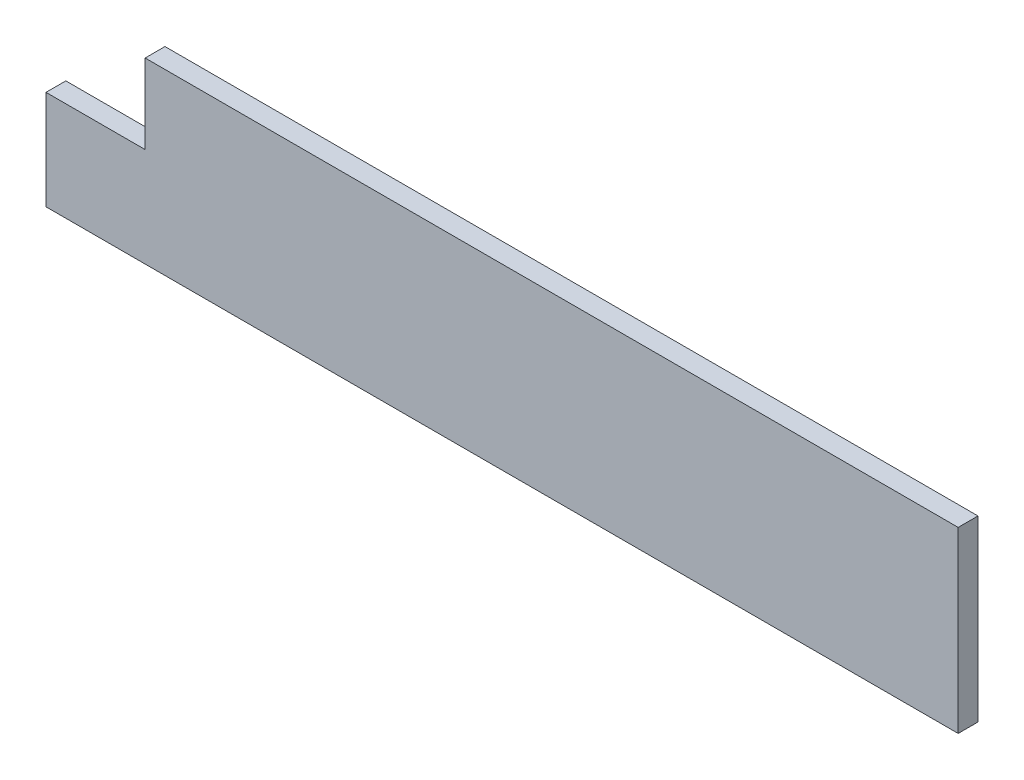
ISO-10303-21;
HEADER;
FILE_DESCRIPTION(('STEP AP214'),'2;1');
FILE_NAME('part.step','',(''),(''),'','','');
FILE_SCHEMA(('AUTOMOTIVE_DESIGN { 1 0 10303 214 1 1 1 1 }'));
ENDSEC;
DATA;
#1=APPLICATION_CONTEXT('core data for automotive mechanical design processes');
#2=APPLICATION_PROTOCOL_DEFINITION('international standard','automotive_design',2000,#1);
#3=PRODUCT_CONTEXT('',#1,'mechanical');
#4=PRODUCT('Part','Part','',(#3));
#5=PRODUCT_RELATED_PRODUCT_CATEGORY('part','',(#4));
#6=PRODUCT_DEFINITION_FORMATION('','',#4);
#7=PRODUCT_DEFINITION_CONTEXT('part definition',#1,'design');
#8=PRODUCT_DEFINITION('design','',#6,#7);
#9=PRODUCT_DEFINITION_SHAPE('','',#8);
#10=(LENGTH_UNIT() NAMED_UNIT(*) SI_UNIT(.MILLI.,.METRE.));
#11=(NAMED_UNIT(*) PLANE_ANGLE_UNIT() SI_UNIT($,.RADIAN.));
#12=(NAMED_UNIT(*) SI_UNIT($,.STERADIAN.) SOLID_ANGLE_UNIT());
#13=UNCERTAINTY_MEASURE_WITH_UNIT(LENGTH_MEASURE(1.E-05),#10,'distance_accuracy_value','');
#14=(GEOMETRIC_REPRESENTATION_CONTEXT(3) GLOBAL_UNCERTAINTY_ASSIGNED_CONTEXT((#13)) GLOBAL_UNIT_ASSIGNED_CONTEXT((#10,
#11,#12)) REPRESENTATION_CONTEXT('',''));
#15=CARTESIAN_POINT('',(0.,0.,0.));
#16=DIRECTION('',(0.,0.,1.));
#17=DIRECTION('',(1.,0.,0.));
#18=AXIS2_PLACEMENT_3D('',#15,#16,#17);
#19=CARTESIAN_POINT('',(0.,0.,6.35));
#20=DIRECTION('',(-1.,0.,0.));
#21=DIRECTION('',(0.,0.,1.));
#22=AXIS2_PLACEMENT_3D('',#19,#20,#21);
#23=PLANE('',#22);
#24=DIRECTION('',(0.,0.,1.));
#25=VECTOR('',#24,1.);
#26=CARTESIAN_POINT('',(0.,31.75,0.));
#27=LINE('',#26,#25);
#28=CARTESIAN_POINT('',(0.,31.75,0.));
#29=VERTEX_POINT('',#28);
#30=CARTESIAN_POINT('',(0.,31.75,6.35));
#31=VERTEX_POINT('',#30);
#32=EDGE_CURVE('E104',#29,#31,#27,.T.);
#33=ORIENTED_EDGE('',*,*,#32,.F.);
#34=DIRECTION('',(0.,1.,0.));
#35=VECTOR('',#34,1.);
#36=CARTESIAN_POINT('',(0.,0.,0.));
#37=LINE('',#36,#35);
#38=CARTESIAN_POINT('',(0.,0.,0.));
#39=VERTEX_POINT('',#38);
#40=EDGE_CURVE('E111',#39,#29,#37,.T.);
#41=ORIENTED_EDGE('',*,*,#40,.F.);
#42=DIRECTION('',(0.,0.,-1.));
#43=VECTOR('',#42,1.);
#44=CARTESIAN_POINT('',(0.,0.,6.35));
#45=LINE('',#44,#43);
#46=CARTESIAN_POINT('',(0.,0.,6.35));
#47=VERTEX_POINT('',#46);
#48=EDGE_CURVE('E11',#47,#39,#45,.T.);
#49=ORIENTED_EDGE('',*,*,#48,.F.);
#50=DIRECTION('',(0.,1.,0.));
#51=VECTOR('',#50,1.);
#52=CARTESIAN_POINT('',(0.,0.,6.35));
#53=LINE('',#52,#51);
#54=EDGE_CURVE('E113',#47,#31,#53,.T.);
#55=ORIENTED_EDGE('',*,*,#54,.T.);
#56=EDGE_LOOP('',(#33,#41,#49,#55));
#57=FACE_BOUND('',#56,.T.);
#58=ADVANCED_FACE('F39',(#57),#23,.T.);
#59=CARTESIAN_POINT('',(0.,0.,6.35));
#60=DIRECTION('',(0.,1.,0.));
#61=DIRECTION('',(0.,0.,1.));
#62=AXIS2_PLACEMENT_3D('',#59,#60,#61);
#63=PLANE('',#62);
#64=DIRECTION('',(1.,0.,0.));
#65=VECTOR('',#64,1.);
#66=CARTESIAN_POINT('',(0.,0.,0.));
#67=LINE('',#66,#65);
#68=CARTESIAN_POINT('',(292.1,0.,0.));
#69=VERTEX_POINT('',#68);
#70=EDGE_CURVE('E118',#39,#69,#67,.T.);
#71=ORIENTED_EDGE('',*,*,#70,.T.);
#72=DIRECTION('',(0.,0.,-1.));
#73=VECTOR('',#72,1.);
#74=CARTESIAN_POINT('',(292.1,0.,6.35));
#75=LINE('',#74,#73);
#76=CARTESIAN_POINT('',(292.1,0.,6.35));
#77=VERTEX_POINT('',#76);
#78=EDGE_CURVE('E48',#77,#69,#75,.T.);
#79=ORIENTED_EDGE('',*,*,#78,.F.);
#80=DIRECTION('',(1.,0.,0.));
#81=VECTOR('',#80,1.);
#82=CARTESIAN_POINT('',(0.,0.,6.35));
#83=LINE('',#82,#81);
#84=EDGE_CURVE('E131',#47,#77,#83,.T.);
#85=ORIENTED_EDGE('',*,*,#84,.F.);
#86=ORIENTED_EDGE('',*,*,#48,.T.);
#87=EDGE_LOOP('',(#71,#79,#85,#86));
#88=FACE_BOUND('',#87,.T.);
#89=ADVANCED_FACE('F175',(#88),#63,.F.);
#90=CARTESIAN_POINT('',(292.1,0.,6.35));
#91=DIRECTION('',(-1.,0.,0.));
#92=DIRECTION('',(0.,0.,1.));
#93=AXIS2_PLACEMENT_3D('',#90,#91,#92);
#94=PLANE('',#93);
#95=DIRECTION('',(0.,1.,0.));
#96=VECTOR('',#95,1.);
#97=CARTESIAN_POINT('',(292.1,0.,0.));
#98=LINE('',#97,#96);
#99=CARTESIAN_POINT('',(292.1,57.15,0.));
#100=VERTEX_POINT('',#99);
#101=EDGE_CURVE('E125',#69,#100,#98,.T.);
#102=ORIENTED_EDGE('',*,*,#101,.T.);
#103=DIRECTION('',(0.,0.,-1.));
#104=VECTOR('',#103,1.);
#105=CARTESIAN_POINT('',(292.1,57.15,6.35));
#106=LINE('',#105,#104);
#107=CARTESIAN_POINT('',(292.1,57.15,6.35));
#108=VERTEX_POINT('',#107);
#109=EDGE_CURVE('E42',#108,#100,#106,.T.);
#110=ORIENTED_EDGE('',*,*,#109,.F.);
#111=DIRECTION('',(0.,1.,0.));
#112=VECTOR('',#111,1.);
#113=CARTESIAN_POINT('',(292.1,0.,6.35));
#114=LINE('',#113,#112);
#115=EDGE_CURVE('E147',#77,#108,#114,.T.);
#116=ORIENTED_EDGE('',*,*,#115,.F.);
#117=ORIENTED_EDGE('',*,*,#78,.T.);
#118=EDGE_LOOP('',(#102,#110,#116,#117));
#119=FACE_BOUND('',#118,.T.);
#120=ADVANCED_FACE('F179',(#119),#94,.F.);
#121=CARTESIAN_POINT('',(0.,57.15,6.35));
#122=DIRECTION('',(0.,1.,0.));
#123=DIRECTION('',(0.,0.,1.));
#124=AXIS2_PLACEMENT_3D('',#121,#122,#123);
#125=PLANE('',#124);
#126=DIRECTION('',(0.,0.,1.));
#127=VECTOR('',#126,1.);
#128=CARTESIAN_POINT('',(31.75,57.15,0.));
#129=LINE('',#128,#127);
#130=CARTESIAN_POINT('',(31.75,57.15,0.));
#131=VERTEX_POINT('',#130);
#132=CARTESIAN_POINT('',(31.75,57.15,6.35));
#133=VERTEX_POINT('',#132);
#134=EDGE_CURVE('E156',#131,#133,#129,.T.);
#135=ORIENTED_EDGE('',*,*,#134,.T.);
#136=DIRECTION('',(1.,0.,0.));
#137=VECTOR('',#136,1.);
#138=CARTESIAN_POINT('',(0.,57.15,6.35));
#139=LINE('',#138,#137);
#140=EDGE_CURVE('E84',#133,#108,#139,.T.);
#141=ORIENTED_EDGE('',*,*,#140,.T.);
#142=ORIENTED_EDGE('',*,*,#109,.T.);
#143=DIRECTION('',(1.,0.,0.));
#144=VECTOR('',#143,1.);
#145=CARTESIAN_POINT('',(0.,57.15,0.));
#146=LINE('',#145,#144);
#147=EDGE_CURVE('E120',#131,#100,#146,.T.);
#148=ORIENTED_EDGE('',*,*,#147,.F.);
#149=EDGE_LOOP('',(#135,#141,#142,#148));
#150=FACE_BOUND('',#149,.T.);
#151=ADVANCED_FACE('F163',(#150),#125,.T.);
#152=CARTESIAN_POINT('',(0.,0.,6.35));
#153=DIRECTION('',(0.,0.,-1.));
#154=DIRECTION('',(-1.,0.,0.));
#155=AXIS2_PLACEMENT_3D('',#152,#153,#154);
#156=PLANE('',#155);
#157=ORIENTED_EDGE('',*,*,#140,.F.);
#158=DIRECTION('',(0.,-1.,0.));
#159=VECTOR('',#158,1.);
#160=CARTESIAN_POINT('',(31.75,0.,6.35));
#161=LINE('',#160,#159);
#162=CARTESIAN_POINT('',(31.75,31.75,6.35));
#163=VERTEX_POINT('',#162);
#164=EDGE_CURVE('E121',#133,#163,#161,.T.);
#165=ORIENTED_EDGE('',*,*,#164,.T.);
#166=DIRECTION('',(-1.,0.,0.));
#167=VECTOR('',#166,1.);
#168=CARTESIAN_POINT('',(0.,31.75,6.35));
#169=LINE('',#168,#167);
#170=EDGE_CURVE('E128',#163,#31,#169,.T.);
#171=ORIENTED_EDGE('',*,*,#170,.T.);
#172=ORIENTED_EDGE('',*,*,#54,.F.);
#173=ORIENTED_EDGE('',*,*,#84,.T.);
#174=ORIENTED_EDGE('',*,*,#115,.T.);
#175=EDGE_LOOP('',(#157,#165,#171,#172,#173,#174));
#176=FACE_BOUND('',#175,.T.);
#177=ADVANCED_FACE('F164',(#176),#156,.F.);
#178=CARTESIAN_POINT('',(0.,0.,0.));
#179=DIRECTION('',(0.,0.,-1.));
#180=DIRECTION('',(-1.,0.,0.));
#181=AXIS2_PLACEMENT_3D('',#178,#179,#180);
#182=PLANE('',#181);
#183=DIRECTION('',(0.,1.,0.));
#184=VECTOR('',#183,1.);
#185=CARTESIAN_POINT('',(31.75,57.15,0.));
#186=LINE('',#185,#184);
#187=CARTESIAN_POINT('',(31.75,31.75,0.));
#188=VERTEX_POINT('',#187);
#189=EDGE_CURVE('E56',#188,#131,#186,.T.);
#190=ORIENTED_EDGE('',*,*,#189,.T.);
#191=ORIENTED_EDGE('',*,*,#147,.T.);
#192=ORIENTED_EDGE('',*,*,#101,.F.);
#193=ORIENTED_EDGE('',*,*,#70,.F.);
#194=ORIENTED_EDGE('',*,*,#40,.T.);
#195=DIRECTION('',(1.,0.,0.));
#196=VECTOR('',#195,1.);
#197=CARTESIAN_POINT('',(0.,31.75,0.));
#198=LINE('',#197,#196);
#199=EDGE_CURVE('E101',#29,#188,#198,.T.);
#200=ORIENTED_EDGE('',*,*,#199,.T.);
#201=EDGE_LOOP('',(#190,#191,#192,#193,#194,#200));
#202=FACE_BOUND('',#201,.T.);
#203=ADVANCED_FACE('F116',(#202),#182,.T.);
#204=CARTESIAN_POINT('',(31.75,57.15,0.));
#205=DIRECTION('',(1.,0.,0.));
#206=DIRECTION('',(0.,0.,-1.));
#207=AXIS2_PLACEMENT_3D('',#204,#205,#206);
#208=PLANE('',#207);
#209=ORIENTED_EDGE('',*,*,#134,.F.);
#210=ORIENTED_EDGE('',*,*,#189,.F.);
#211=DIRECTION('',(0.,0.,1.));
#212=VECTOR('',#211,1.);
#213=CARTESIAN_POINT('',(31.75,31.75,0.));
#214=LINE('',#213,#212);
#215=EDGE_CURVE('E106',#188,#163,#214,.T.);
#216=ORIENTED_EDGE('',*,*,#215,.T.);
#217=ORIENTED_EDGE('',*,*,#164,.F.);
#218=EDGE_LOOP('',(#209,#210,#216,#217));
#219=FACE_BOUND('',#218,.T.);
#220=ADVANCED_FACE('F165',(#219),#208,.F.);
#221=CARTESIAN_POINT('',(0.,31.75,0.));
#222=DIRECTION('',(0.,-1.,0.));
#223=DIRECTION('',(0.,0.,-1.));
#224=AXIS2_PLACEMENT_3D('',#221,#222,#223);
#225=PLANE('',#224);
#226=ORIENTED_EDGE('',*,*,#215,.F.);
#227=ORIENTED_EDGE('',*,*,#199,.F.);
#228=ORIENTED_EDGE('',*,*,#32,.T.);
#229=ORIENTED_EDGE('',*,*,#170,.F.);
#230=EDGE_LOOP('',(#226,#227,#228,#229));
#231=FACE_BOUND('',#230,.T.);
#232=ADVANCED_FACE('F103',(#231),#225,.F.);
#233=CLOSED_SHELL('',(#58,#89,#120,#151,#177,#203,#220,#232));
#234=MANIFOLD_SOLID_BREP('B2',#233);
#235=ADVANCED_BREP_SHAPE_REPRESENTATION('',(#18,#234),#14);
#236=SHAPE_DEFINITION_REPRESENTATION(#9,#235);
ENDSEC;
END-ISO-10303-21;
